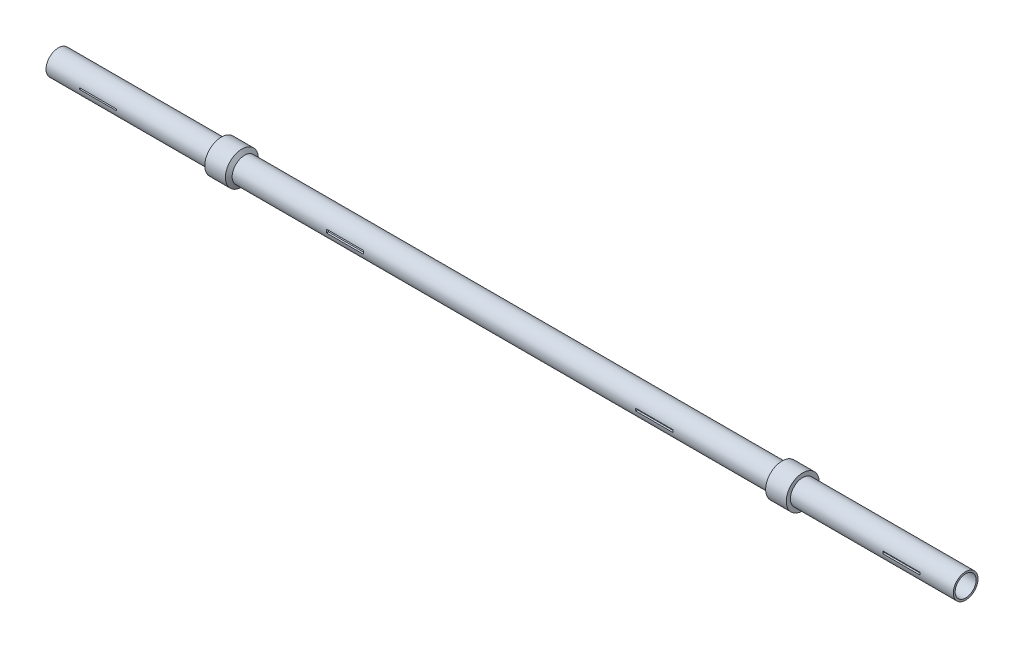
ISO-10303-21;
HEADER;
FILE_DESCRIPTION(('STEP AP214'),'2;1');
FILE_NAME('part.step','',(''),(''),'','','');
FILE_SCHEMA(('AUTOMOTIVE_DESIGN { 1 0 10303 214 1 1 1 1 }'));
ENDSEC;
DATA;
#1=APPLICATION_CONTEXT('core data for automotive mechanical design processes');
#2=APPLICATION_PROTOCOL_DEFINITION('international standard','automotive_design',2000,#1);
#3=PRODUCT_CONTEXT('',#1,'mechanical');
#4=PRODUCT('Part','Part','',(#3));
#5=PRODUCT_RELATED_PRODUCT_CATEGORY('part','',(#4));
#6=PRODUCT_DEFINITION_FORMATION('','',#4);
#7=PRODUCT_DEFINITION_CONTEXT('part definition',#1,'design');
#8=PRODUCT_DEFINITION('design','',#6,#7);
#9=PRODUCT_DEFINITION_SHAPE('','',#8);
#10=(LENGTH_UNIT() NAMED_UNIT(*) SI_UNIT(.MILLI.,.METRE.));
#11=(NAMED_UNIT(*) PLANE_ANGLE_UNIT() SI_UNIT($,.RADIAN.));
#12=(NAMED_UNIT(*) SI_UNIT($,.STERADIAN.) SOLID_ANGLE_UNIT());
#13=UNCERTAINTY_MEASURE_WITH_UNIT(LENGTH_MEASURE(1.E-05),#10,'distance_accuracy_value','');
#14=(GEOMETRIC_REPRESENTATION_CONTEXT(3) GLOBAL_UNCERTAINTY_ASSIGNED_CONTEXT((#13)) GLOBAL_UNIT_ASSIGNED_CONTEXT((#10,
#11,#12)) REPRESENTATION_CONTEXT('',''));
#15=CARTESIAN_POINT('',(0.,0.,0.));
#16=DIRECTION('',(0.,0.,1.));
#17=DIRECTION('',(1.,0.,0.));
#18=AXIS2_PLACEMENT_3D('',#15,#16,#17);
#19=CARTESIAN_POINT('',(-1343.71911040698,0.,0.));
#20=DIRECTION('',(1.,0.,0.));
#21=DIRECTION('',(0.,0.,-1.));
#22=AXIS2_PLACEMENT_3D('',#19,#20,#21);
#23=CYLINDRICAL_SURFACE('',#22,12.7212399784205);
#24=DIRECTION('',(1.,0.,0.));
#25=VECTOR('',#24,1.);
#26=CARTESIAN_POINT('',(-1343.71911040698,-1.50069655306055,12.6324129304024));
#27=LINE('',#26,#25);
#28=CARTESIAN_POINT('',(815.791337888926,-1.50069655306042,12.6324129304024));
#29=VERTEX_POINT('',#28);
#30=CARTESIAN_POINT('',(770.770441297112,-1.50069655306042,12.6324129304024));
#31=VERTEX_POINT('',#30);
#32=EDGE_CURVE('E266',#29,#31,#27,.F.);
#33=ORIENTED_EDGE('',*,*,#32,.F.);
#34=CARTESIAN_POINT('',(815.791337888926,0.,0.));
#35=DIRECTION('',(-1.,0.,0.));
#36=DIRECTION('',(0.,0.,1.));
#37=AXIS2_PLACEMENT_3D('',#34,#35,#36);
#38=CIRCLE('',#37,12.7212399784205);
#39=CARTESIAN_POINT('',(815.791337888926,1.50069655306054,12.6324129304024));
#40=VERTEX_POINT('',#39);
#41=EDGE_CURVE('E272',#29,#40,#38,.T.);
#42=ORIENTED_EDGE('',*,*,#41,.T.);
#43=DIRECTION('',(1.,0.,0.));
#44=VECTOR('',#43,1.);
#45=CARTESIAN_POINT('',(-1343.71911040698,1.50069655306041,12.6324129304024));
#46=LINE('',#45,#44);
#47=CARTESIAN_POINT('',(770.770441297112,1.50069655306041,12.6324129304024));
#48=VERTEX_POINT('',#47);
#49=EDGE_CURVE('E252',#40,#48,#46,.F.);
#50=ORIENTED_EDGE('',*,*,#49,.T.);
#51=CARTESIAN_POINT('',(770.770441297112,0.,0.));
#52=DIRECTION('',(-1.,0.,0.));
#53=DIRECTION('',(0.,0.,1.));
#54=AXIS2_PLACEMENT_3D('',#51,#52,#53);
#55=CIRCLE('',#54,12.7212399784205);
#56=EDGE_CURVE('E251',#31,#48,#55,.T.);
#57=ORIENTED_EDGE('',*,*,#56,.F.);
#58=EDGE_LOOP('',(#33,#42,#50,#57));
#59=FACE_BOUND('',#58,.T.);
#60=DIRECTION('',(1.,0.,0.));
#61=VECTOR('',#60,1.);
#62=CARTESIAN_POINT('',(-1343.71911040698,-1.50069655306065,12.6324129304024));
#63=LINE('',#62,#61);
#64=CARTESIAN_POINT('',(516.291337888926,-1.50069655306054,12.6324129304024));
#65=VERTEX_POINT('',#64);
#66=CARTESIAN_POINT('',(471.270441297112,-1.50069655306054,12.6324129304024));
#67=VERTEX_POINT('',#66);
#68=EDGE_CURVE('E301',#65,#67,#63,.F.);
#69=ORIENTED_EDGE('',*,*,#68,.F.);
#70=CARTESIAN_POINT('',(516.291337888926,0.,0.));
#71=DIRECTION('',(-1.,0.,0.));
#72=DIRECTION('',(0.,-1.,0.));
#73=AXIS2_PLACEMENT_3D('',#70,#71,#72);
#74=CIRCLE('',#73,12.7212399784205);
#75=CARTESIAN_POINT('',(516.291337888927,1.50069655306063,12.6324129304024));
#76=VERTEX_POINT('',#75);
#77=EDGE_CURVE('E308',#65,#76,#74,.T.);
#78=ORIENTED_EDGE('',*,*,#77,.T.);
#79=DIRECTION('',(1.,0.,0.));
#80=VECTOR('',#79,1.);
#81=CARTESIAN_POINT('',(-1343.71911040698,1.50069655306052,12.6324129304024));
#82=LINE('',#81,#80);
#83=CARTESIAN_POINT('',(471.270441297112,1.50069655306052,12.6324129304024));
#84=VERTEX_POINT('',#83);
#85=EDGE_CURVE('E291',#76,#84,#82,.F.);
#86=ORIENTED_EDGE('',*,*,#85,.T.);
#87=CARTESIAN_POINT('',(471.270441297112,0.,0.));
#88=DIRECTION('',(-1.,0.,0.));
#89=DIRECTION('',(0.,0.,1.));
#90=AXIS2_PLACEMENT_3D('',#87,#88,#89);
#91=CIRCLE('',#90,12.7212399784205);
#92=EDGE_CURVE('E297',#67,#84,#91,.T.);
#93=ORIENTED_EDGE('',*,*,#92,.F.);
#94=EDGE_LOOP('',(#69,#78,#86,#93));
#95=FACE_BOUND('',#94,.T.);
#96=DIRECTION('',(1.,0.,0.));
#97=VECTOR('',#96,1.);
#98=CARTESIAN_POINT('',(-1343.71911040698,-2.02321230294039,12.5593215806347));
#99=LINE('',#98,#97);
#100=CARTESIAN_POINT('',(141.255975495604,-2.02321230294031,12.5593215806347));
#101=VERTEX_POINT('',#100);
#102=CARTESIAN_POINT('',(96.3058036904345,-2.02321230294031,12.5593215806347));
#103=VERTEX_POINT('',#102);
#104=EDGE_CURVE('E334',#101,#103,#99,.F.);
#105=ORIENTED_EDGE('',*,*,#104,.F.);
#106=CARTESIAN_POINT('',(141.255975495604,0.,0.));
#107=DIRECTION('',(-1.,0.,0.));
#108=DIRECTION('',(0.,0.,1.));
#109=AXIS2_PLACEMENT_3D('',#106,#107,#108);
#110=CIRCLE('',#109,12.7212399784205);
#111=CARTESIAN_POINT('',(141.255975495604,2.02321230294035,12.5593215806347));
#112=VERTEX_POINT('',#111);
#113=EDGE_CURVE('E338',#101,#112,#110,.T.);
#114=ORIENTED_EDGE('',*,*,#113,.T.);
#115=DIRECTION('',(1.,0.,0.));
#116=VECTOR('',#115,1.);
#117=CARTESIAN_POINT('',(-1343.71911040698,2.02321230294027,12.5593215806347));
#118=LINE('',#117,#116);
#119=CARTESIAN_POINT('',(96.3058036904343,2.02321230294027,12.5593215806347));
#120=VERTEX_POINT('',#119);
#121=EDGE_CURVE('E324',#112,#120,#118,.F.);
#122=ORIENTED_EDGE('',*,*,#121,.T.);
#123=CARTESIAN_POINT('',(96.3058036904345,0.,0.));
#124=DIRECTION('',(-1.,0.,0.));
#125=DIRECTION('',(0.,0.,1.));
#126=AXIS2_PLACEMENT_3D('',#123,#124,#125);
#127=CIRCLE('',#126,12.7212399784205);
#128=EDGE_CURVE('E330',#103,#120,#127,.T.);
#129=ORIENTED_EDGE('',*,*,#128,.F.);
#130=EDGE_LOOP('',(#105,#114,#122,#129));
#131=FACE_BOUND('',#130,.T.);
#132=DIRECTION('',(1.,0.,0.));
#133=VECTOR('',#132,1.);
#134=CARTESIAN_POINT('',(-1343.71911040698,0.911393527752899,12.6885502885923));
#135=LINE('',#134,#133);
#136=CARTESIAN_POINT('',(-158.169682229954,0.911393527752899,12.6885502885923));
#137=VERTEX_POINT('',#136);
#138=CARTESIAN_POINT('',(-203.268538584007,0.911393527752899,12.6885502885923));
#139=VERTEX_POINT('',#138);
#140=EDGE_CURVE('E416',#137,#139,#135,.F.);
#141=ORIENTED_EDGE('',*,*,#140,.T.);
#142=CARTESIAN_POINT('',(-203.268538584007,0.,0.));
#143=DIRECTION('',(1.,0.,0.));
#144=DIRECTION('',(0.,0.,-1.));
#145=AXIS2_PLACEMENT_3D('',#142,#143,#144);
#146=CIRCLE('',#145,12.7212399784205);
#147=CARTESIAN_POINT('',(-203.268538584007,-0.911393527752899,12.6885502885923));
#148=VERTEX_POINT('',#147);
#149=EDGE_CURVE('E420',#139,#148,#146,.T.);
#150=ORIENTED_EDGE('',*,*,#149,.T.);
#151=DIRECTION('',(1.,0.,0.));
#152=VECTOR('',#151,1.);
#153=CARTESIAN_POINT('',(-1343.71911040698,-0.911393527752899,12.6885502885923));
#154=LINE('',#153,#152);
#155=CARTESIAN_POINT('',(-158.169682229954,-0.911393527752899,12.6885502885923));
#156=VERTEX_POINT('',#155);
#157=EDGE_CURVE('E409',#156,#148,#154,.F.);
#158=ORIENTED_EDGE('',*,*,#157,.F.);
#159=CARTESIAN_POINT('',(-158.169682229954,0.,0.));
#160=DIRECTION('',(-1.,0.,0.));
#161=DIRECTION('',(0.,0.,1.));
#162=AXIS2_PLACEMENT_3D('',#159,#160,#161);
#163=CIRCLE('',#162,12.7212399784205);
#164=EDGE_CURVE('E413',#156,#137,#163,.T.);
#165=ORIENTED_EDGE('',*,*,#164,.T.);
#166=EDGE_LOOP('',(#141,#150,#158,#165));
#167=FACE_BOUND('',#166,.T.);
#168=CARTESIAN_POINT('',(-243.719110406981,0.,0.));
#169=DIRECTION('',(-1.,0.,0.));
#170=DIRECTION('',(0.,0.,1.));
#171=AXIS2_PLACEMENT_3D('',#168,#169,#170);
#172=CIRCLE('',#171,12.7212399784205);
#173=CARTESIAN_POINT('',(-243.719110406981,0.,12.7212399784205));
#174=VERTEX_POINT('',#173);
#175=EDGE_CURVE('E378',#174,#174,#172,.F.);
#176=ORIENTED_EDGE('',*,*,#175,.F.);
#177=EDGE_LOOP('',(#176));
#178=FACE_BOUND('',#177,.T.);
#179=CARTESIAN_POINT('',(856.280889593019,0.,0.));
#180=DIRECTION('',(-1.,0.,0.));
#181=DIRECTION('',(0.,0.,1.));
#182=AXIS2_PLACEMENT_3D('',#179,#180,#181);
#183=CIRCLE('',#182,12.7212399784205);
#184=CARTESIAN_POINT('',(856.280889593019,0.,12.7212399784205));
#185=VERTEX_POINT('',#184);
#186=EDGE_CURVE('E375',#185,#185,#183,.T.);
#187=ORIENTED_EDGE('',*,*,#186,.F.);
#188=EDGE_LOOP('',(#187));
#189=FACE_BOUND('',#188,.T.);
#190=DIRECTION('',(1.,0.,0.));
#191=VECTOR('',#190,1.);
#192=CARTESIAN_POINT('',(-1343.71911040698,-0.911393527752899,-12.6885502885923));
#193=LINE('',#192,#191);
#194=CARTESIAN_POINT('',(-203.268538584007,-0.911393527752899,-12.6885502885923));
#195=VERTEX_POINT('',#194);
#196=CARTESIAN_POINT('',(-158.169682229954,-0.911393527752899,-12.6885502885923));
#197=VERTEX_POINT('',#196);
#198=EDGE_CURVE('E423',#195,#197,#193,.T.);
#199=ORIENTED_EDGE('',*,*,#198,.F.);
#200=CARTESIAN_POINT('',(-203.268538584007,0.911393527752899,-12.6885502885923));
#201=VERTEX_POINT('',#200);
#202=EDGE_CURVE('E424',#195,#201,#146,.T.);
#203=ORIENTED_EDGE('',*,*,#202,.T.);
#204=DIRECTION('',(1.,0.,0.));
#205=VECTOR('',#204,1.);
#206=CARTESIAN_POINT('',(-1343.71911040698,0.911393527752899,-12.6885502885923));
#207=LINE('',#206,#205);
#208=CARTESIAN_POINT('',(-158.169682229954,0.911393527752899,-12.6885502885923));
#209=VERTEX_POINT('',#208);
#210=EDGE_CURVE('E426',#201,#209,#207,.T.);
#211=ORIENTED_EDGE('',*,*,#210,.T.);
#212=EDGE_CURVE('E417',#209,#197,#163,.T.);
#213=ORIENTED_EDGE('',*,*,#212,.T.);
#214=EDGE_LOOP('',(#199,#203,#211,#213));
#215=FACE_BOUND('',#214,.T.);
#216=DIRECTION('',(1.,0.,0.));
#217=VECTOR('',#216,1.);
#218=CARTESIAN_POINT('',(-1343.71911040698,2.02321230294027,-12.5593215806347));
#219=LINE('',#218,#217);
#220=CARTESIAN_POINT('',(96.3058036904344,2.02321230294035,-12.5593215806347));
#221=VERTEX_POINT('',#220);
#222=CARTESIAN_POINT('',(141.255975495604,2.02321230294027,-12.5593215806347));
#223=VERTEX_POINT('',#222);
#224=EDGE_CURVE('E327',#221,#223,#219,.T.);
#225=ORIENTED_EDGE('',*,*,#224,.T.);
#226=CARTESIAN_POINT('',(141.255975495604,-2.02321230294031,-12.5593215806347));
#227=VERTEX_POINT('',#226);
#228=EDGE_CURVE('E341',#223,#227,#110,.T.);
#229=ORIENTED_EDGE('',*,*,#228,.T.);
#230=DIRECTION('',(1.,0.,0.));
#231=VECTOR('',#230,1.);
#232=CARTESIAN_POINT('',(-1343.71911040698,-2.02321230294039,-12.5593215806347));
#233=LINE('',#232,#231);
#234=CARTESIAN_POINT('',(96.3058036904345,-2.02321230294031,-12.5593215806347));
#235=VERTEX_POINT('',#234);
#236=EDGE_CURVE('E336',#235,#227,#233,.T.);
#237=ORIENTED_EDGE('',*,*,#236,.F.);
#238=EDGE_CURVE('E333',#221,#235,#127,.T.);
#239=ORIENTED_EDGE('',*,*,#238,.F.);
#240=EDGE_LOOP('',(#225,#229,#237,#239));
#241=FACE_BOUND('',#240,.T.);
#242=DIRECTION('',(1.,0.,0.));
#243=VECTOR('',#242,1.);
#244=CARTESIAN_POINT('',(-1343.71911040698,1.50069655306052,-12.6324129304024));
#245=LINE('',#244,#243);
#246=CARTESIAN_POINT('',(471.270441297112,1.50069655306063,-12.6324129304024));
#247=VERTEX_POINT('',#246);
#248=CARTESIAN_POINT('',(516.291337888927,1.50069655306052,-12.6324129304024));
#249=VERTEX_POINT('',#248);
#250=EDGE_CURVE('E294',#247,#249,#245,.T.);
#251=ORIENTED_EDGE('',*,*,#250,.T.);
#252=CARTESIAN_POINT('',(516.291337888926,-1.50069655306054,-12.6324129304024));
#253=VERTEX_POINT('',#252);
#254=EDGE_CURVE('E305',#249,#253,#74,.T.);
#255=ORIENTED_EDGE('',*,*,#254,.T.);
#256=DIRECTION('',(1.,0.,0.));
#257=VECTOR('',#256,1.);
#258=CARTESIAN_POINT('',(-1343.71911040698,-1.50069655306065,-12.6324129304024));
#259=LINE('',#258,#257);
#260=CARTESIAN_POINT('',(471.270441297112,-1.50069655306054,-12.6324129304024));
#261=VERTEX_POINT('',#260);
#262=EDGE_CURVE('E303',#261,#253,#259,.T.);
#263=ORIENTED_EDGE('',*,*,#262,.F.);
#264=EDGE_CURVE('E300',#247,#261,#91,.T.);
#265=ORIENTED_EDGE('',*,*,#264,.F.);
#266=EDGE_LOOP('',(#251,#255,#263,#265));
#267=FACE_BOUND('',#266,.T.);
#268=DIRECTION('',(1.,0.,0.));
#269=VECTOR('',#268,1.);
#270=CARTESIAN_POINT('',(-1343.71911040698,1.50069655306041,-12.6324129304024));
#271=LINE('',#270,#269);
#272=CARTESIAN_POINT('',(770.770441297112,1.50069655306054,-12.6324129304024));
#273=VERTEX_POINT('',#272);
#274=CARTESIAN_POINT('',(815.791337888926,1.50069655306041,-12.6324129304024));
#275=VERTEX_POINT('',#274);
#276=EDGE_CURVE('E243',#273,#275,#271,.T.);
#277=ORIENTED_EDGE('',*,*,#276,.T.);
#278=CARTESIAN_POINT('',(815.791337888926,-1.50069655306042,-12.6324129304024));
#279=VERTEX_POINT('',#278);
#280=EDGE_CURVE('E275',#275,#279,#38,.T.);
#281=ORIENTED_EDGE('',*,*,#280,.T.);
#282=DIRECTION('',(1.,0.,0.));
#283=VECTOR('',#282,1.);
#284=CARTESIAN_POINT('',(-1343.71911040698,-1.50069655306055,-12.6324129304024));
#285=LINE('',#284,#283);
#286=CARTESIAN_POINT('',(770.770441297112,-1.50069655306042,-12.6324129304024));
#287=VERTEX_POINT('',#286);
#288=EDGE_CURVE('E265',#287,#279,#285,.T.);
#289=ORIENTED_EDGE('',*,*,#288,.F.);
#290=EDGE_CURVE('E257',#273,#287,#55,.T.);
#291=ORIENTED_EDGE('',*,*,#290,.F.);
#292=EDGE_LOOP('',(#277,#281,#289,#291));
#293=FACE_BOUND('',#292,.T.);
#294=ADVANCED_FACE('F34',(#59,#95,#131,#167,#178,#189,#215,#241,#267,#293),#23,.F.);
#295=CARTESIAN_POINT('',(-243.719110406981,0.,0.));
#296=DIRECTION('',(-1.,0.,0.));
#297=DIRECTION('',(0.,0.,1.));
#298=AXIS2_PLACEMENT_3D('',#295,#296,#297);
#299=CYLINDRICAL_SURFACE('',#298,15.0000000000001);
#300=DIRECTION('',(-1.,0.,0.));
#301=VECTOR('',#300,1.);
#302=CARTESIAN_POINT('',(-243.719110406981,-1.50069655306048,-14.9247415339641));
#303=LINE('',#302,#301);
#304=CARTESIAN_POINT('',(815.791337888926,-1.50069655306042,-14.9247415339641));
#305=VERTEX_POINT('',#304);
#306=CARTESIAN_POINT('',(770.770441297112,-1.50069655306042,-14.9247415339642));
#307=VERTEX_POINT('',#306);
#308=EDGE_CURVE('E468',#305,#307,#303,.T.);
#309=ORIENTED_EDGE('',*,*,#308,.F.);
#310=CARTESIAN_POINT('',(815.791337888927,0.,0.));
#311=DIRECTION('',(-1.,0.,0.));
#312=DIRECTION('',(0.,0.,1.));
#313=AXIS2_PLACEMENT_3D('',#310,#311,#312);
#314=CIRCLE('',#313,15.0000000000001);
#315=CARTESIAN_POINT('',(815.791337888926,1.50069655306054,-14.9247415339641));
#316=VERTEX_POINT('',#315);
#317=EDGE_CURVE('E44',#305,#316,#314,.F.);
#318=ORIENTED_EDGE('',*,*,#317,.T.);
#319=DIRECTION('',(-1.,0.,0.));
#320=VECTOR('',#319,1.);
#321=CARTESIAN_POINT('',(-243.719110406981,1.50069655306048,-14.9247415339641));
#322=LINE('',#321,#320);
#323=CARTESIAN_POINT('',(770.770441297112,1.50069655306048,-14.9247415339641));
#324=VERTEX_POINT('',#323);
#325=EDGE_CURVE('E465',#316,#324,#322,.T.);
#326=ORIENTED_EDGE('',*,*,#325,.T.);
#327=CARTESIAN_POINT('',(770.770441297112,0.,0.));
#328=DIRECTION('',(-1.,0.,0.));
#329=DIRECTION('',(0.,0.,1.));
#330=AXIS2_PLACEMENT_3D('',#327,#328,#329);
#331=CIRCLE('',#330,15.0000000000001);
#332=EDGE_CURVE('E260',#307,#324,#331,.F.);
#333=ORIENTED_EDGE('',*,*,#332,.F.);
#334=EDGE_LOOP('',(#309,#318,#326,#333));
#335=FACE_BOUND('',#334,.T.);
#336=CARTESIAN_POINT('',(856.280889593019,0.,0.));
#337=DIRECTION('',(-1.,0.,0.));
#338=DIRECTION('',(0.,0.,1.));
#339=AXIS2_PLACEMENT_3D('',#336,#337,#338);
#340=CIRCLE('',#339,15.);
#341=CARTESIAN_POINT('',(856.280889593019,0.,15.));
#342=VERTEX_POINT('',#341);
#343=EDGE_CURVE('E406',#342,#342,#340,.T.);
#344=ORIENTED_EDGE('',*,*,#343,.T.);
#345=EDGE_LOOP('',(#344));
#346=FACE_BOUND('',#345,.T.);
#347=CARTESIAN_POINT('',(658.780889593019,0.,0.));
#348=DIRECTION('',(-1.,0.,0.));
#349=DIRECTION('',(0.,0.,1.));
#350=AXIS2_PLACEMENT_3D('',#347,#348,#349);
#351=CIRCLE('',#350,15.0000000000001);
#352=CARTESIAN_POINT('',(658.780889593019,0.,15.0000000000001));
#353=VERTEX_POINT('',#352);
#354=EDGE_CURVE('E403',#353,#353,#351,.T.);
#355=ORIENTED_EDGE('',*,*,#354,.F.);
#356=EDGE_LOOP('',(#355));
#357=FACE_BOUND('',#356,.T.);
#358=DIRECTION('',(-1.,0.,0.));
#359=VECTOR('',#358,1.);
#360=CARTESIAN_POINT('',(-243.719110406981,1.50069655306048,14.9247415339641));
#361=LINE('',#360,#359);
#362=CARTESIAN_POINT('',(770.770441297112,1.50069655306054,14.9247415339641));
#363=VERTEX_POINT('',#362);
#364=CARTESIAN_POINT('',(815.791337888927,1.50069655306048,14.9247415339641));
#365=VERTEX_POINT('',#364);
#366=EDGE_CURVE('E471',#363,#365,#361,.F.);
#367=ORIENTED_EDGE('',*,*,#366,.T.);
#368=CARTESIAN_POINT('',(815.791337888926,-1.50069655306042,14.9247415339641));
#369=VERTEX_POINT('',#368);
#370=EDGE_CURVE('E11',#365,#369,#314,.F.);
#371=ORIENTED_EDGE('',*,*,#370,.T.);
#372=DIRECTION('',(-1.,0.,0.));
#373=VECTOR('',#372,1.);
#374=CARTESIAN_POINT('',(-243.719110406981,-1.50069655306048,14.9247415339641));
#375=LINE('',#374,#373);
#376=CARTESIAN_POINT('',(770.770441297112,-1.50069655306042,14.9247415339642));
#377=VERTEX_POINT('',#376);
#378=EDGE_CURVE('E38',#377,#369,#375,.F.);
#379=ORIENTED_EDGE('',*,*,#378,.F.);
#380=EDGE_CURVE('E469',#363,#377,#331,.F.);
#381=ORIENTED_EDGE('',*,*,#380,.F.);
#382=EDGE_LOOP('',(#367,#371,#379,#381));
#383=FACE_BOUND('',#382,.T.);
#384=ADVANCED_FACE('F492',(#335,#346,#357,#383),#299,.T.);
#385=CARTESIAN_POINT('',(-243.719110406981,0.,0.));
#386=DIRECTION('',(-1.,0.,0.));
#387=DIRECTION('',(0.,0.,1.));
#388=AXIS2_PLACEMENT_3D('',#385,#386,#387);
#389=CYLINDRICAL_SURFACE('',#388,15.);
#390=DIRECTION('',(-1.,0.,0.));
#391=VECTOR('',#390,1.);
#392=CARTESIAN_POINT('',(-243.719110406981,-1.50069655306058,-14.9247415339641));
#393=LINE('',#392,#391);
#394=CARTESIAN_POINT('',(516.291337888926,-1.50069655306054,-14.9247415339641));
#395=VERTEX_POINT('',#394);
#396=CARTESIAN_POINT('',(471.270441297112,-1.50069655306054,-14.9247415339641));
#397=VERTEX_POINT('',#396);
#398=EDGE_CURVE('E453',#395,#397,#393,.T.);
#399=ORIENTED_EDGE('',*,*,#398,.F.);
#400=CARTESIAN_POINT('',(516.291337888926,0.,0.));
#401=DIRECTION('',(-1.,0.,0.));
#402=DIRECTION('',(0.,-1.,0.));
#403=AXIS2_PLACEMENT_3D('',#400,#401,#402);
#404=CIRCLE('',#403,15.);
#405=CARTESIAN_POINT('',(516.291337888927,1.50069655306063,-14.9247415339641));
#406=VERTEX_POINT('',#405);
#407=EDGE_CURVE('E456',#395,#406,#404,.F.);
#408=ORIENTED_EDGE('',*,*,#407,.T.);
#409=DIRECTION('',(-1.,0.,0.));
#410=VECTOR('',#409,1.);
#411=CARTESIAN_POINT('',(-243.719110406981,1.50069655306058,-14.9247415339641));
#412=LINE('',#411,#410);
#413=CARTESIAN_POINT('',(471.270441297112,1.50069655306058,-14.9247415339641));
#414=VERTEX_POINT('',#413);
#415=EDGE_CURVE('E447',#406,#414,#412,.T.);
#416=ORIENTED_EDGE('',*,*,#415,.T.);
#417=CARTESIAN_POINT('',(471.270441297112,0.,0.));
#418=DIRECTION('',(-1.,0.,0.));
#419=DIRECTION('',(0.,0.,1.));
#420=AXIS2_PLACEMENT_3D('',#417,#418,#419);
#421=CIRCLE('',#420,15.);
#422=EDGE_CURVE('E450',#397,#414,#421,.F.);
#423=ORIENTED_EDGE('',*,*,#422,.F.);
#424=EDGE_LOOP('',(#399,#408,#416,#423));
#425=FACE_BOUND('',#424,.T.);
#426=DIRECTION('',(-1.,0.,0.));
#427=VECTOR('',#426,1.);
#428=CARTESIAN_POINT('',(-243.719110406981,-2.02321230294033,-14.8629274363172));
#429=LINE('',#428,#427);
#430=CARTESIAN_POINT('',(141.255975495604,-2.02321230294031,-14.8629274363172));
#431=VERTEX_POINT('',#430);
#432=CARTESIAN_POINT('',(96.3058036904344,-2.02321230294031,-14.8629274363172));
#433=VERTEX_POINT('',#432);
#434=EDGE_CURVE('E435',#431,#433,#429,.T.);
#435=ORIENTED_EDGE('',*,*,#434,.F.);
#436=CARTESIAN_POINT('',(141.255975495604,0.,0.));
#437=DIRECTION('',(-1.,0.,0.));
#438=DIRECTION('',(0.,0.,1.));
#439=AXIS2_PLACEMENT_3D('',#436,#437,#438);
#440=CIRCLE('',#439,15.);
#441=CARTESIAN_POINT('',(141.255975495604,2.02321230294035,-14.8629274363172));
#442=VERTEX_POINT('',#441);
#443=EDGE_CURVE('E438',#431,#442,#440,.F.);
#444=ORIENTED_EDGE('',*,*,#443,.T.);
#445=DIRECTION('',(-1.,0.,0.));
#446=VECTOR('',#445,1.);
#447=CARTESIAN_POINT('',(-243.719110406981,2.02321230294033,-14.8629274363172));
#448=LINE('',#447,#446);
#449=CARTESIAN_POINT('',(96.3058036904344,2.02321230294033,-14.8629274363172));
#450=VERTEX_POINT('',#449);
#451=EDGE_CURVE('E429',#442,#450,#448,.T.);
#452=ORIENTED_EDGE('',*,*,#451,.T.);
#453=CARTESIAN_POINT('',(96.3058036904344,0.,0.));
#454=DIRECTION('',(-1.,0.,0.));
#455=DIRECTION('',(0.,0.,1.));
#456=AXIS2_PLACEMENT_3D('',#453,#454,#455);
#457=CIRCLE('',#456,15.);
#458=EDGE_CURVE('E432',#433,#450,#457,.F.);
#459=ORIENTED_EDGE('',*,*,#458,.F.);
#460=EDGE_LOOP('',(#435,#444,#452,#459));
#461=FACE_BOUND('',#460,.T.);
#462=CARTESIAN_POINT('',(630.572753037591,0.,0.));
#463=DIRECTION('',(-1.,0.,0.));
#464=DIRECTION('',(0.,0.,1.));
#465=AXIS2_PLACEMENT_3D('',#462,#463,#464);
#466=CIRCLE('',#465,15.);
#467=CARTESIAN_POINT('',(630.572753037591,0.,15.));
#468=VERTEX_POINT('',#467);
#469=EDGE_CURVE('E394',#468,#468,#466,.T.);
#470=ORIENTED_EDGE('',*,*,#469,.T.);
#471=EDGE_LOOP('',(#470));
#472=FACE_BOUND('',#471,.T.);
#473=CARTESIAN_POINT('',(-18.0109738515526,0.,0.));
#474=DIRECTION('',(-1.,0.,0.));
#475=DIRECTION('',(0.,0.,1.));
#476=AXIS2_PLACEMENT_3D('',#473,#474,#475);
#477=CIRCLE('',#476,15.);
#478=CARTESIAN_POINT('',(-18.0109738515526,0.,15.));
#479=VERTEX_POINT('',#478);
#480=EDGE_CURVE('E391',#479,#479,#477,.T.);
#481=ORIENTED_EDGE('',*,*,#480,.F.);
#482=EDGE_LOOP('',(#481));
#483=FACE_BOUND('',#482,.T.);
#484=DIRECTION('',(-1.,0.,0.));
#485=VECTOR('',#484,1.);
#486=CARTESIAN_POINT('',(-243.719110406981,2.02321230294033,14.8629274363172));
#487=LINE('',#486,#485);
#488=CARTESIAN_POINT('',(96.3058036904344,2.02321230294035,14.8629274363172));
#489=VERTEX_POINT('',#488);
#490=CARTESIAN_POINT('',(141.255975495604,2.02321230294033,14.8629274363172));
#491=VERTEX_POINT('',#490);
#492=EDGE_CURVE('E441',#489,#491,#487,.F.);
#493=ORIENTED_EDGE('',*,*,#492,.T.);
#494=CARTESIAN_POINT('',(141.255975495604,-2.02321230294031,14.8629274363172));
#495=VERTEX_POINT('',#494);
#496=EDGE_CURVE('E442',#491,#495,#440,.F.);
#497=ORIENTED_EDGE('',*,*,#496,.T.);
#498=DIRECTION('',(-1.,0.,0.));
#499=VECTOR('',#498,1.);
#500=CARTESIAN_POINT('',(-243.719110406981,-2.02321230294033,14.8629274363172));
#501=LINE('',#500,#499);
#502=CARTESIAN_POINT('',(96.3058036904344,-2.02321230294031,14.8629274363172));
#503=VERTEX_POINT('',#502);
#504=EDGE_CURVE('E445',#503,#495,#501,.F.);
#505=ORIENTED_EDGE('',*,*,#504,.F.);
#506=EDGE_CURVE('E436',#489,#503,#457,.F.);
#507=ORIENTED_EDGE('',*,*,#506,.F.);
#508=EDGE_LOOP('',(#493,#497,#505,#507));
#509=FACE_BOUND('',#508,.T.);
#510=DIRECTION('',(-1.,0.,0.));
#511=VECTOR('',#510,1.);
#512=CARTESIAN_POINT('',(-243.719110406981,1.50069655306058,14.9247415339641));
#513=LINE('',#512,#511);
#514=CARTESIAN_POINT('',(471.270441297112,1.50069655306063,14.9247415339641));
#515=VERTEX_POINT('',#514);
#516=CARTESIAN_POINT('',(516.291337888926,1.50069655306058,14.9247415339641));
#517=VERTEX_POINT('',#516);
#518=EDGE_CURVE('E459',#515,#517,#513,.F.);
#519=ORIENTED_EDGE('',*,*,#518,.T.);
#520=CARTESIAN_POINT('',(516.291337888926,-1.50069655306054,14.9247415339641));
#521=VERTEX_POINT('',#520);
#522=EDGE_CURVE('E460',#517,#521,#404,.F.);
#523=ORIENTED_EDGE('',*,*,#522,.T.);
#524=DIRECTION('',(-1.,0.,0.));
#525=VECTOR('',#524,1.);
#526=CARTESIAN_POINT('',(-243.719110406981,-1.50069655306058,14.9247415339641));
#527=LINE('',#526,#525);
#528=CARTESIAN_POINT('',(471.270441297112,-1.50069655306054,14.9247415339641));
#529=VERTEX_POINT('',#528);
#530=EDGE_CURVE('E463',#529,#521,#527,.F.);
#531=ORIENTED_EDGE('',*,*,#530,.F.);
#532=EDGE_CURVE('E454',#515,#529,#421,.F.);
#533=ORIENTED_EDGE('',*,*,#532,.F.);
#534=EDGE_LOOP('',(#519,#523,#531,#533));
#535=FACE_BOUND('',#534,.T.);
#536=ADVANCED_FACE('F494',(#425,#461,#472,#483,#509,#535),#389,.T.);
#537=CARTESIAN_POINT('',(-243.719110406981,0.,0.));
#538=DIRECTION('',(-1.,0.,0.));
#539=DIRECTION('',(0.,0.,1.));
#540=AXIS2_PLACEMENT_3D('',#537,#538,#539);
#541=CYLINDRICAL_SURFACE('',#540,15.);
#542=DIRECTION('',(-1.,0.,0.));
#543=VECTOR('',#542,1.);
#544=CARTESIAN_POINT('',(-243.719110406981,0.911393527752899,-14.9722864599089));
#545=LINE('',#544,#543);
#546=CARTESIAN_POINT('',(-158.169682229954,0.911393527752899,-14.9722864599089));
#547=VERTEX_POINT('',#546);
#548=CARTESIAN_POINT('',(-203.268538584007,0.911393527752899,-14.9722864599089));
#549=VERTEX_POINT('',#548);
#550=EDGE_CURVE('E365',#547,#549,#545,.T.);
#551=ORIENTED_EDGE('',*,*,#550,.T.);
#552=CARTESIAN_POINT('',(-203.268538584007,0.,0.));
#553=DIRECTION('',(1.,0.,0.));
#554=DIRECTION('',(0.,0.,-1.));
#555=AXIS2_PLACEMENT_3D('',#552,#553,#554);
#556=CIRCLE('',#555,15.);
#557=CARTESIAN_POINT('',(-203.268538584007,-0.911393527752899,-14.9722864599089));
#558=VERTEX_POINT('',#557);
#559=EDGE_CURVE('E371',#549,#558,#556,.F.);
#560=ORIENTED_EDGE('',*,*,#559,.T.);
#561=DIRECTION('',(-1.,0.,0.));
#562=VECTOR('',#561,1.);
#563=CARTESIAN_POINT('',(-243.719110406981,-0.911393527752899,-14.9722864599089));
#564=LINE('',#563,#562);
#565=CARTESIAN_POINT('',(-158.169682229954,-0.911393527752899,-14.9722864599089));
#566=VERTEX_POINT('',#565);
#567=EDGE_CURVE('E357',#566,#558,#564,.T.);
#568=ORIENTED_EDGE('',*,*,#567,.F.);
#569=CARTESIAN_POINT('',(-158.169682229954,0.,0.));
#570=DIRECTION('',(-1.,0.,0.));
#571=DIRECTION('',(0.,0.,1.));
#572=AXIS2_PLACEMENT_3D('',#569,#570,#571);
#573=CIRCLE('',#572,15.);
#574=EDGE_CURVE('E364',#566,#547,#573,.F.);
#575=ORIENTED_EDGE('',*,*,#574,.T.);
#576=EDGE_LOOP('',(#551,#560,#568,#575));
#577=FACE_BOUND('',#576,.T.);
#578=CARTESIAN_POINT('',(-46.2191104069807,0.,0.));
#579=DIRECTION('',(-1.,0.,0.));
#580=DIRECTION('',(0.,0.,1.));
#581=AXIS2_PLACEMENT_3D('',#578,#579,#580);
#582=CIRCLE('',#581,15.);
#583=CARTESIAN_POINT('',(-46.2191104069807,0.,15.));
#584=VERTEX_POINT('',#583);
#585=EDGE_CURVE('E382',#584,#584,#582,.T.);
#586=ORIENTED_EDGE('',*,*,#585,.T.);
#587=EDGE_LOOP('',(#586));
#588=FACE_BOUND('',#587,.T.);
#589=CARTESIAN_POINT('',(-243.719110406981,0.,0.));
#590=DIRECTION('',(-1.,0.,0.));
#591=DIRECTION('',(0.,0.,1.));
#592=AXIS2_PLACEMENT_3D('',#589,#590,#591);
#593=CIRCLE('',#592,15.);
#594=CARTESIAN_POINT('',(-243.719110406981,0.,15.));
#595=VERTEX_POINT('',#594);
#596=EDGE_CURVE('E379',#595,#595,#593,.T.);
#597=ORIENTED_EDGE('',*,*,#596,.F.);
#598=EDGE_LOOP('',(#597));
#599=FACE_BOUND('',#598,.T.);
#600=DIRECTION('',(-1.,0.,0.));
#601=VECTOR('',#600,1.);
#602=CARTESIAN_POINT('',(-243.719110406981,-0.911393527752899,14.9722864599089));
#603=LINE('',#602,#601);
#604=CARTESIAN_POINT('',(-203.268538584007,-0.911393527752899,14.9722864599089));
#605=VERTEX_POINT('',#604);
#606=CARTESIAN_POINT('',(-158.169682229954,-0.911393527752899,14.9722864599089));
#607=VERTEX_POINT('',#606);
#608=EDGE_CURVE('E359',#605,#607,#603,.F.);
#609=ORIENTED_EDGE('',*,*,#608,.F.);
#610=CARTESIAN_POINT('',(-203.268538584007,0.911393527752899,14.9722864599089));
#611=VERTEX_POINT('',#610);
#612=EDGE_CURVE('E374',#605,#611,#556,.F.);
#613=ORIENTED_EDGE('',*,*,#612,.T.);
#614=DIRECTION('',(-1.,0.,0.));
#615=VECTOR('',#614,1.);
#616=CARTESIAN_POINT('',(-243.719110406981,0.911393527752899,14.9722864599089));
#617=LINE('',#616,#615);
#618=CARTESIAN_POINT('',(-158.169682229954,0.911393527752899,14.9722864599089));
#619=VERTEX_POINT('',#618);
#620=EDGE_CURVE('E368',#611,#619,#617,.F.);
#621=ORIENTED_EDGE('',*,*,#620,.T.);
#622=EDGE_CURVE('E361',#619,#607,#573,.F.);
#623=ORIENTED_EDGE('',*,*,#622,.T.);
#624=EDGE_LOOP('',(#609,#613,#621,#623));
#625=FACE_BOUND('',#624,.T.);
#626=ADVANCED_FACE('F500',(#577,#588,#599,#625),#541,.T.);
#627=CARTESIAN_POINT('',(856.280889593019,15.,0.));
#628=DIRECTION('',(1.,0.,0.));
#629=DIRECTION('',(0.,0.,-1.));
#630=AXIS2_PLACEMENT_3D('',#627,#628,#629);
#631=PLANE('',#630);
#632=ORIENTED_EDGE('',*,*,#343,.F.);
#633=EDGE_LOOP('',(#632));
#634=FACE_BOUND('',#633,.T.);
#635=ORIENTED_EDGE('',*,*,#186,.T.);
#636=EDGE_LOOP('',(#635));
#637=FACE_BOUND('',#636,.T.);
#638=ADVANCED_FACE('F36',(#634,#637),#631,.T.);
#639=CARTESIAN_POINT('',(-243.719110406981,0.,0.));
#640=DIRECTION('',(-1.,0.,0.));
#641=DIRECTION('',(0.,0.,1.));
#642=AXIS2_PLACEMENT_3D('',#639,#640,#641);
#643=PLANE('',#642);
#644=ORIENTED_EDGE('',*,*,#596,.T.);
#645=EDGE_LOOP('',(#644));
#646=FACE_BOUND('',#645,.T.);
#647=ORIENTED_EDGE('',*,*,#175,.T.);
#648=EDGE_LOOP('',(#647));
#649=FACE_BOUND('',#648,.T.);
#650=ADVANCED_FACE('F512',(#646,#649),#643,.T.);
#651=CARTESIAN_POINT('',(658.780889593019,15.0000000000001,0.));
#652=DIRECTION('',(1.,0.,0.));
#653=DIRECTION('',(0.,0.,-1.));
#654=AXIS2_PLACEMENT_3D('',#651,#652,#653);
#655=PLANE('',#654);
#656=ORIENTED_EDGE('',*,*,#354,.T.);
#657=EDGE_LOOP('',(#656));
#658=FACE_BOUND('',#657,.T.);
#659=CARTESIAN_POINT('',(658.780889593019,0.,0.));
#660=DIRECTION('',(-1.,0.,0.));
#661=DIRECTION('',(0.,0.,1.));
#662=AXIS2_PLACEMENT_3D('',#659,#660,#661);
#663=CIRCLE('',#662,19.9999999999996);
#664=CARTESIAN_POINT('',(658.780889593019,0.,19.9999999999996));
#665=VERTEX_POINT('',#664);
#666=EDGE_CURVE('E400',#665,#665,#663,.T.);
#667=ORIENTED_EDGE('',*,*,#666,.F.);
#668=EDGE_LOOP('',(#667));
#669=FACE_BOUND('',#668,.T.);
#670=ADVANCED_FACE('F508',(#658,#669),#655,.T.);
#671=CARTESIAN_POINT('',(-243.719110406981,0.,0.));
#672=DIRECTION('',(-1.,0.,0.));
#673=DIRECTION('',(0.,0.,1.));
#674=AXIS2_PLACEMENT_3D('',#671,#672,#673);
#675=CYLINDRICAL_SURFACE('',#674,19.9999999999996);
#676=ORIENTED_EDGE('',*,*,#666,.T.);
#677=EDGE_LOOP('',(#676));
#678=FACE_BOUND('',#677,.T.);
#679=CARTESIAN_POINT('',(633.780889593019,0.,0.));
#680=DIRECTION('',(-1.,0.,0.));
#681=DIRECTION('',(0.,0.,1.));
#682=AXIS2_PLACEMENT_3D('',#679,#680,#681);
#683=CIRCLE('',#682,19.9999999999996);
#684=CARTESIAN_POINT('',(633.780889593019,0.,19.9999999999996));
#685=VERTEX_POINT('',#684);
#686=EDGE_CURVE('E397',#685,#685,#683,.T.);
#687=ORIENTED_EDGE('',*,*,#686,.F.);
#688=EDGE_LOOP('',(#687));
#689=FACE_BOUND('',#688,.T.);
#690=ADVANCED_FACE('F511',(#678,#689),#675,.T.);
#691=CARTESIAN_POINT('',(630.572753037591,0.,0.));
#692=DIRECTION('',(1.,0.,0.));
#693=DIRECTION('',(0.,0.,-1.));
#694=AXIS2_PLACEMENT_3D('',#691,#692,#693);
#695=CONICAL_SURFACE('',#694,15.,1.000329539697);
#696=ORIENTED_EDGE('',*,*,#686,.T.);
#697=EDGE_LOOP('',(#696));
#698=FACE_BOUND('',#697,.T.);
#699=ORIENTED_EDGE('',*,*,#469,.F.);
#700=EDGE_LOOP('',(#699));
#701=FACE_BOUND('',#700,.T.);
#702=ADVANCED_FACE('F516',(#698,#701),#695,.T.);
#703=CARTESIAN_POINT('',(-21.2191104069807,0.,0.));
#704=DIRECTION('',(-1.,0.,0.));
#705=DIRECTION('',(0.,0.,1.));
#706=AXIS2_PLACEMENT_3D('',#703,#704,#705);
#707=CONICAL_SURFACE('',#706,20.,1.00032953969704);
#708=ORIENTED_EDGE('',*,*,#480,.T.);
#709=EDGE_LOOP('',(#708));
#710=FACE_BOUND('',#709,.T.);
#711=CARTESIAN_POINT('',(-21.2191104069807,0.,0.));
#712=DIRECTION('',(-1.,0.,0.));
#713=DIRECTION('',(0.,0.,1.));
#714=AXIS2_PLACEMENT_3D('',#711,#712,#713);
#715=CIRCLE('',#714,20.);
#716=CARTESIAN_POINT('',(-21.2191104069807,0.,20.));
#717=VERTEX_POINT('',#716);
#718=EDGE_CURVE('E388',#717,#717,#715,.T.);
#719=ORIENTED_EDGE('',*,*,#718,.F.);
#720=EDGE_LOOP('',(#719));
#721=FACE_BOUND('',#720,.T.);
#722=ADVANCED_FACE('F519',(#710,#721),#707,.T.);
#723=CARTESIAN_POINT('',(-243.719110406981,0.,0.));
#724=DIRECTION('',(-1.,0.,0.));
#725=DIRECTION('',(0.,0.,1.));
#726=AXIS2_PLACEMENT_3D('',#723,#724,#725);
#727=CYLINDRICAL_SURFACE('',#726,20.);
#728=ORIENTED_EDGE('',*,*,#718,.T.);
#729=EDGE_LOOP('',(#728));
#730=FACE_BOUND('',#729,.T.);
#731=CARTESIAN_POINT('',(-46.2191104069807,0.,0.));
#732=DIRECTION('',(-1.,0.,0.));
#733=DIRECTION('',(0.,0.,1.));
#734=AXIS2_PLACEMENT_3D('',#731,#732,#733);
#735=CIRCLE('',#734,20.);
#736=CARTESIAN_POINT('',(-46.2191104069807,0.,20.));
#737=VERTEX_POINT('',#736);
#738=EDGE_CURVE('E385',#737,#737,#735,.T.);
#739=ORIENTED_EDGE('',*,*,#738,.F.);
#740=EDGE_LOOP('',(#739));
#741=FACE_BOUND('',#740,.T.);
#742=ADVANCED_FACE('F524',(#730,#741),#727,.T.);
#743=CARTESIAN_POINT('',(-46.2191104069807,15.,0.));
#744=DIRECTION('',(-1.,0.,0.));
#745=DIRECTION('',(0.,0.,1.));
#746=AXIS2_PLACEMENT_3D('',#743,#744,#745);
#747=PLANE('',#746);
#748=ORIENTED_EDGE('',*,*,#738,.T.);
#749=EDGE_LOOP('',(#748));
#750=FACE_BOUND('',#749,.T.);
#751=ORIENTED_EDGE('',*,*,#585,.F.);
#752=EDGE_LOOP('',(#751));
#753=FACE_BOUND('',#752,.T.);
#754=ADVANCED_FACE('F528',(#750,#753),#747,.T.);
#755=CARTESIAN_POINT('',(0.,-0.911393527752899,-20.));
#756=DIRECTION('',(0.,-1.,0.));
#757=DIRECTION('',(0.,0.,-1.));
#758=AXIS2_PLACEMENT_3D('',#755,#756,#757);
#759=PLANE('',#758);
#760=ORIENTED_EDGE('',*,*,#608,.T.);
#761=DIRECTION('',(0.,0.,1.));
#762=VECTOR('',#761,1.);
#763=CARTESIAN_POINT('',(-158.169682229954,-0.911393527752899,-20.));
#764=LINE('',#763,#762);
#765=EDGE_CURVE('E351',#156,#607,#764,.T.);
#766=ORIENTED_EDGE('',*,*,#765,.F.);
#767=ORIENTED_EDGE('',*,*,#157,.T.);
#768=DIRECTION('',(0.,0.,1.));
#769=VECTOR('',#768,1.);
#770=CARTESIAN_POINT('',(-203.268538584007,-0.911393527752899,-20.));
#771=LINE('',#770,#769);
#772=EDGE_CURVE('E355',#148,#605,#771,.T.);
#773=ORIENTED_EDGE('',*,*,#772,.T.);
#774=EDGE_LOOP('',(#760,#766,#767,#773));
#775=FACE_BOUND('',#774,.T.);
#776=ADVANCED_FACE('F532',(#775),#759,.F.);
#777=CARTESIAN_POINT('',(-158.169682229954,0.,-20.));
#778=DIRECTION('',(-1.,0.,0.));
#779=DIRECTION('',(0.,0.,1.));
#780=AXIS2_PLACEMENT_3D('',#777,#778,#779);
#781=PLANE('',#780);
#782=DIRECTION('',(0.,0.,1.));
#783=VECTOR('',#782,1.);
#784=CARTESIAN_POINT('',(-158.169682229954,0.911393527752899,-20.));
#785=LINE('',#784,#783);
#786=EDGE_CURVE('E347',#137,#619,#785,.T.);
#787=ORIENTED_EDGE('',*,*,#786,.F.);
#788=ORIENTED_EDGE('',*,*,#164,.F.);
#789=ORIENTED_EDGE('',*,*,#765,.T.);
#790=ORIENTED_EDGE('',*,*,#622,.F.);
#791=EDGE_LOOP('',(#787,#788,#789,#790));
#792=FACE_BOUND('',#791,.T.);
#793=ADVANCED_FACE('F549',(#792),#781,.T.);
#794=CARTESIAN_POINT('',(0.,0.911393527752899,-20.));
#795=DIRECTION('',(0.,-1.,0.));
#796=DIRECTION('',(0.,0.,-1.));
#797=AXIS2_PLACEMENT_3D('',#794,#795,#796);
#798=PLANE('',#797);
#799=DIRECTION('',(0.,0.,1.));
#800=VECTOR('',#799,1.);
#801=CARTESIAN_POINT('',(-203.268538584007,0.911393527752899,-20.));
#802=LINE('',#801,#800);
#803=EDGE_CURVE('E342',#139,#611,#802,.T.);
#804=ORIENTED_EDGE('',*,*,#803,.F.);
#805=ORIENTED_EDGE('',*,*,#140,.F.);
#806=ORIENTED_EDGE('',*,*,#786,.T.);
#807=ORIENTED_EDGE('',*,*,#620,.F.);
#808=EDGE_LOOP('',(#804,#805,#806,#807));
#809=FACE_BOUND('',#808,.T.);
#810=ADVANCED_FACE('F553',(#809),#798,.T.);
#811=CARTESIAN_POINT('',(-203.268538584007,0.,-20.));
#812=DIRECTION('',(1.,0.,0.));
#813=DIRECTION('',(0.,0.,-1.));
#814=AXIS2_PLACEMENT_3D('',#811,#812,#813);
#815=PLANE('',#814);
#816=ORIENTED_EDGE('',*,*,#772,.F.);
#817=ORIENTED_EDGE('',*,*,#149,.F.);
#818=ORIENTED_EDGE('',*,*,#803,.T.);
#819=ORIENTED_EDGE('',*,*,#612,.F.);
#820=EDGE_LOOP('',(#816,#817,#818,#819));
#821=FACE_BOUND('',#820,.T.);
#822=ADVANCED_FACE('F546',(#821),#815,.T.);
#823=EDGE_CURVE('E346',#547,#209,#785,.T.);
#824=ORIENTED_EDGE('',*,*,#823,.T.);
#825=ORIENTED_EDGE('',*,*,#210,.F.);
#826=EDGE_CURVE('E345',#549,#201,#802,.T.);
#827=ORIENTED_EDGE('',*,*,#826,.F.);
#828=ORIENTED_EDGE('',*,*,#550,.F.);
#829=EDGE_LOOP('',(#824,#825,#827,#828));
#830=FACE_BOUND('',#829,.T.);
#831=ADVANCED_FACE('F559',(#830),#798,.T.);
#832=EDGE_CURVE('E350',#566,#197,#764,.T.);
#833=ORIENTED_EDGE('',*,*,#832,.T.);
#834=ORIENTED_EDGE('',*,*,#212,.F.);
#835=ORIENTED_EDGE('',*,*,#823,.F.);
#836=ORIENTED_EDGE('',*,*,#574,.F.);
#837=EDGE_LOOP('',(#833,#834,#835,#836));
#838=FACE_BOUND('',#837,.T.);
#839=ADVANCED_FACE('F555',(#838),#781,.T.);
#840=ORIENTED_EDGE('',*,*,#567,.T.);
#841=EDGE_CURVE('E354',#558,#195,#771,.T.);
#842=ORIENTED_EDGE('',*,*,#841,.T.);
#843=ORIENTED_EDGE('',*,*,#198,.T.);
#844=ORIENTED_EDGE('',*,*,#832,.F.);
#845=EDGE_LOOP('',(#840,#842,#843,#844));
#846=FACE_BOUND('',#845,.T.);
#847=ADVANCED_FACE('F544',(#846),#759,.F.);
#848=ORIENTED_EDGE('',*,*,#826,.T.);
#849=ORIENTED_EDGE('',*,*,#202,.F.);
#850=ORIENTED_EDGE('',*,*,#841,.F.);
#851=ORIENTED_EDGE('',*,*,#559,.F.);
#852=EDGE_LOOP('',(#848,#849,#850,#851));
#853=FACE_BOUND('',#852,.T.);
#854=ADVANCED_FACE('F540',(#853),#815,.T.);
#855=CARTESIAN_POINT('',(0.,2.02321230294035,-20.));
#856=DIRECTION('',(0.,-1.,0.));
#857=DIRECTION('',(1.,0.,0.));
#858=AXIS2_PLACEMENT_3D('',#855,#856,#857);
#859=PLANE('',#858);
#860=DIRECTION('',(0.,0.,1.));
#861=VECTOR('',#860,1.);
#862=CARTESIAN_POINT('',(96.3058036904344,2.02321230294035,-20.));
#863=LINE('',#862,#861);
#864=EDGE_CURVE('E317',#450,#221,#863,.T.);
#865=ORIENTED_EDGE('',*,*,#864,.F.);
#866=ORIENTED_EDGE('',*,*,#451,.F.);
#867=DIRECTION('',(0.,0.,1.));
#868=VECTOR('',#867,1.);
#869=CARTESIAN_POINT('',(141.255975495604,2.02321230294035,-20.));
#870=LINE('',#869,#868);
#871=EDGE_CURVE('E321',#442,#223,#870,.T.);
#872=ORIENTED_EDGE('',*,*,#871,.T.);
#873=ORIENTED_EDGE('',*,*,#224,.F.);
#874=EDGE_LOOP('',(#865,#866,#872,#873));
#875=FACE_BOUND('',#874,.T.);
#876=ADVANCED_FACE('F543',(#875),#859,.T.);
#877=CARTESIAN_POINT('',(96.3058036904344,0.,-20.));
#878=DIRECTION('',(-1.,0.,0.));
#879=DIRECTION('',(0.,0.,1.));
#880=AXIS2_PLACEMENT_3D('',#877,#878,#879);
#881=PLANE('',#880);
#882=ORIENTED_EDGE('',*,*,#238,.T.);
#883=DIRECTION('',(0.,0.,1.));
#884=VECTOR('',#883,1.);
#885=CARTESIAN_POINT('',(96.3058036904344,-2.02321230294031,-20.));
#886=LINE('',#885,#884);
#887=EDGE_CURVE('E313',#433,#235,#886,.T.);
#888=ORIENTED_EDGE('',*,*,#887,.F.);
#889=ORIENTED_EDGE('',*,*,#458,.T.);
#890=ORIENTED_EDGE('',*,*,#864,.T.);
#891=EDGE_LOOP('',(#882,#888,#889,#890));
#892=FACE_BOUND('',#891,.T.);
#893=ADVANCED_FACE('F575',(#892),#881,.F.);
#894=CARTESIAN_POINT('',(0.,-2.02321230294032,-20.));
#895=DIRECTION('',(0.,-1.,0.));
#896=DIRECTION('',(1.,0.,0.));
#897=AXIS2_PLACEMENT_3D('',#894,#895,#896);
#898=PLANE('',#897);
#899=ORIENTED_EDGE('',*,*,#236,.T.);
#900=DIRECTION('',(0.,0.,1.));
#901=VECTOR('',#900,1.);
#902=CARTESIAN_POINT('',(141.255975495604,-2.02321230294031,-20.));
#903=LINE('',#902,#901);
#904=EDGE_CURVE('E312',#431,#227,#903,.T.);
#905=ORIENTED_EDGE('',*,*,#904,.F.);
#906=ORIENTED_EDGE('',*,*,#434,.T.);
#907=ORIENTED_EDGE('',*,*,#887,.T.);
#908=EDGE_LOOP('',(#899,#905,#906,#907));
#909=FACE_BOUND('',#908,.T.);
#910=ADVANCED_FACE('F579',(#909),#898,.F.);
#911=CARTESIAN_POINT('',(141.255975495604,0.,-20.));
#912=DIRECTION('',(-1.,0.,0.));
#913=DIRECTION('',(0.,0.,1.));
#914=AXIS2_PLACEMENT_3D('',#911,#912,#913);
#915=PLANE('',#914);
#916=ORIENTED_EDGE('',*,*,#871,.F.);
#917=ORIENTED_EDGE('',*,*,#443,.F.);
#918=ORIENTED_EDGE('',*,*,#904,.T.);
#919=ORIENTED_EDGE('',*,*,#228,.F.);
#920=EDGE_LOOP('',(#916,#917,#918,#919));
#921=FACE_BOUND('',#920,.T.);
#922=ADVANCED_FACE('F564',(#921),#915,.T.);
#923=EDGE_CURVE('E309',#101,#495,#903,.T.);
#924=ORIENTED_EDGE('',*,*,#923,.T.);
#925=ORIENTED_EDGE('',*,*,#496,.F.);
#926=EDGE_CURVE('E322',#112,#491,#870,.T.);
#927=ORIENTED_EDGE('',*,*,#926,.F.);
#928=ORIENTED_EDGE('',*,*,#113,.F.);
#929=EDGE_LOOP('',(#924,#925,#927,#928));
#930=FACE_BOUND('',#929,.T.);
#931=ADVANCED_FACE('F560',(#930),#915,.T.);
#932=ORIENTED_EDGE('',*,*,#104,.T.);
#933=EDGE_CURVE('E314',#103,#503,#886,.T.);
#934=ORIENTED_EDGE('',*,*,#933,.T.);
#935=ORIENTED_EDGE('',*,*,#504,.T.);
#936=ORIENTED_EDGE('',*,*,#923,.F.);
#937=EDGE_LOOP('',(#932,#934,#935,#936));
#938=FACE_BOUND('',#937,.T.);
#939=ADVANCED_FACE('F563',(#938),#898,.F.);
#940=ORIENTED_EDGE('',*,*,#128,.T.);
#941=EDGE_CURVE('E318',#120,#489,#863,.T.);
#942=ORIENTED_EDGE('',*,*,#941,.T.);
#943=ORIENTED_EDGE('',*,*,#506,.T.);
#944=ORIENTED_EDGE('',*,*,#933,.F.);
#945=EDGE_LOOP('',(#940,#942,#943,#944));
#946=FACE_BOUND('',#945,.T.);
#947=ADVANCED_FACE('F570',(#946),#881,.F.);
#948=ORIENTED_EDGE('',*,*,#926,.T.);
#949=ORIENTED_EDGE('',*,*,#492,.F.);
#950=ORIENTED_EDGE('',*,*,#941,.F.);
#951=ORIENTED_EDGE('',*,*,#121,.F.);
#952=EDGE_LOOP('',(#948,#949,#950,#951));
#953=FACE_BOUND('',#952,.T.);
#954=ADVANCED_FACE('F566',(#953),#859,.T.);
#955=CARTESIAN_POINT('',(0.,1.5006965530606,-20.));
#956=DIRECTION('',(0.,-1.,0.));
#957=DIRECTION('',(1.,0.,0.));
#958=AXIS2_PLACEMENT_3D('',#955,#956,#957);
#959=PLANE('',#958);
#960=DIRECTION('',(0.,0.,1.));
#961=VECTOR('',#960,1.);
#962=CARTESIAN_POINT('',(471.270441297112,1.50069655306063,-20.));
#963=LINE('',#962,#961);
#964=EDGE_CURVE('E284',#414,#247,#963,.T.);
#965=ORIENTED_EDGE('',*,*,#964,.F.);
#966=ORIENTED_EDGE('',*,*,#415,.F.);
#967=DIRECTION('',(0.,0.,1.));
#968=VECTOR('',#967,1.);
#969=CARTESIAN_POINT('',(516.291337888927,1.50069655306063,-20.));
#970=LINE('',#969,#968);
#971=EDGE_CURVE('E288',#406,#249,#970,.T.);
#972=ORIENTED_EDGE('',*,*,#971,.T.);
#973=ORIENTED_EDGE('',*,*,#250,.F.);
#974=EDGE_LOOP('',(#965,#966,#972,#973));
#975=FACE_BOUND('',#974,.T.);
#976=ADVANCED_FACE('F569',(#975),#959,.T.);
#977=CARTESIAN_POINT('',(471.270441297112,0.,-20.));
#978=DIRECTION('',(-1.,0.,0.));
#979=DIRECTION('',(0.,0.,1.));
#980=AXIS2_PLACEMENT_3D('',#977,#978,#979);
#981=PLANE('',#980);
#982=ORIENTED_EDGE('',*,*,#264,.T.);
#983=DIRECTION('',(0.,0.,1.));
#984=VECTOR('',#983,1.);
#985=CARTESIAN_POINT('',(471.270441297112,-1.50069655306054,-20.));
#986=LINE('',#985,#984);
#987=EDGE_CURVE('E280',#397,#261,#986,.T.);
#988=ORIENTED_EDGE('',*,*,#987,.F.);
#989=ORIENTED_EDGE('',*,*,#422,.T.);
#990=ORIENTED_EDGE('',*,*,#964,.T.);
#991=EDGE_LOOP('',(#982,#988,#989,#990));
#992=FACE_BOUND('',#991,.T.);
#993=ADVANCED_FACE('F595',(#992),#981,.F.);
#994=CARTESIAN_POINT('',(0.,-1.50069655306057,-20.));
#995=DIRECTION('',(0.,-1.,0.));
#996=DIRECTION('',(1.,0.,0.));
#997=AXIS2_PLACEMENT_3D('',#994,#995,#996);
#998=PLANE('',#997);
#999=ORIENTED_EDGE('',*,*,#262,.T.);
#1000=DIRECTION('',(0.,0.,1.));
#1001=VECTOR('',#1000,1.);
#1002=CARTESIAN_POINT('',(516.291337888926,-1.50069655306054,-20.));
#1003=LINE('',#1002,#1001);
#1004=EDGE_CURVE('E279',#395,#253,#1003,.T.);
#1005=ORIENTED_EDGE('',*,*,#1004,.F.);
#1006=ORIENTED_EDGE('',*,*,#398,.T.);
#1007=ORIENTED_EDGE('',*,*,#987,.T.);
#1008=EDGE_LOOP('',(#999,#1005,#1006,#1007));
#1009=FACE_BOUND('',#1008,.T.);
#1010=ADVANCED_FACE('F584',(#1009),#998,.F.);
#1011=CARTESIAN_POINT('',(516.291337888926,-1.90977492941464E-11,-20.));
#1012=DIRECTION('',(-1.,0.,0.));
#1013=DIRECTION('',(0.,-1.,0.));
#1014=AXIS2_PLACEMENT_3D('',#1011,#1012,#1013);
#1015=PLANE('',#1014);
#1016=ORIENTED_EDGE('',*,*,#971,.F.);
#1017=ORIENTED_EDGE('',*,*,#407,.F.);
#1018=ORIENTED_EDGE('',*,*,#1004,.T.);
#1019=ORIENTED_EDGE('',*,*,#254,.F.);
#1020=EDGE_LOOP('',(#1016,#1017,#1018,#1019));
#1021=FACE_BOUND('',#1020,.T.);
#1022=ADVANCED_FACE('F580',(#1021),#1015,.T.);
#1023=EDGE_CURVE('E276',#65,#521,#1003,.T.);
#1024=ORIENTED_EDGE('',*,*,#1023,.T.);
#1025=ORIENTED_EDGE('',*,*,#522,.F.);
#1026=EDGE_CURVE('E289',#76,#517,#970,.T.);
#1027=ORIENTED_EDGE('',*,*,#1026,.F.);
#1028=ORIENTED_EDGE('',*,*,#77,.F.);
#1029=EDGE_LOOP('',(#1024,#1025,#1027,#1028));
#1030=FACE_BOUND('',#1029,.T.);
#1031=ADVANCED_FACE('F583',(#1030),#1015,.T.);
#1032=ORIENTED_EDGE('',*,*,#68,.T.);
#1033=EDGE_CURVE('E281',#67,#529,#986,.T.);
#1034=ORIENTED_EDGE('',*,*,#1033,.T.);
#1035=ORIENTED_EDGE('',*,*,#530,.T.);
#1036=ORIENTED_EDGE('',*,*,#1023,.F.);
#1037=EDGE_LOOP('',(#1032,#1034,#1035,#1036));
#1038=FACE_BOUND('',#1037,.T.);
#1039=ADVANCED_FACE('F593',(#1038),#998,.F.);
#1040=ORIENTED_EDGE('',*,*,#92,.T.);
#1041=EDGE_CURVE('E285',#84,#515,#963,.T.);
#1042=ORIENTED_EDGE('',*,*,#1041,.T.);
#1043=ORIENTED_EDGE('',*,*,#532,.T.);
#1044=ORIENTED_EDGE('',*,*,#1033,.F.);
#1045=EDGE_LOOP('',(#1040,#1042,#1043,#1044));
#1046=FACE_BOUND('',#1045,.T.);
#1047=ADVANCED_FACE('F589',(#1046),#981,.F.);
#1048=ORIENTED_EDGE('',*,*,#1026,.T.);
#1049=ORIENTED_EDGE('',*,*,#518,.F.);
#1050=ORIENTED_EDGE('',*,*,#1041,.F.);
#1051=ORIENTED_EDGE('',*,*,#85,.F.);
#1052=EDGE_LOOP('',(#1048,#1049,#1050,#1051));
#1053=FACE_BOUND('',#1052,.T.);
#1054=ADVANCED_FACE('F586',(#1053),#959,.T.);
#1055=CARTESIAN_POINT('',(0.,1.50069655306049,-20.));
#1056=DIRECTION('',(0.,-1.,0.));
#1057=DIRECTION('',(1.,0.,0.));
#1058=AXIS2_PLACEMENT_3D('',#1055,#1056,#1057);
#1059=PLANE('',#1058);
#1060=DIRECTION('',(0.,0.,1.));
#1061=VECTOR('',#1060,1.);
#1062=CARTESIAN_POINT('',(770.770441297112,1.50069655306054,-20.));
#1063=LINE('',#1062,#1061);
#1064=EDGE_CURVE('E246',#324,#273,#1063,.T.);
#1065=ORIENTED_EDGE('',*,*,#1064,.F.);
#1066=ORIENTED_EDGE('',*,*,#325,.F.);
#1067=DIRECTION('',(0.,0.,1.));
#1068=VECTOR('',#1067,1.);
#1069=CARTESIAN_POINT('',(815.791337888926,1.50069655306054,-20.));
#1070=LINE('',#1069,#1068);
#1071=EDGE_CURVE('E51',#316,#275,#1070,.T.);
#1072=ORIENTED_EDGE('',*,*,#1071,.T.);
#1073=ORIENTED_EDGE('',*,*,#276,.F.);
#1074=EDGE_LOOP('',(#1065,#1066,#1072,#1073));
#1075=FACE_BOUND('',#1074,.T.);
#1076=ADVANCED_FACE('F245',(#1075),#1059,.T.);
#1077=CARTESIAN_POINT('',(770.770441297112,0.,-20.));
#1078=DIRECTION('',(-1.,0.,0.));
#1079=DIRECTION('',(0.,0.,1.));
#1080=AXIS2_PLACEMENT_3D('',#1077,#1078,#1079);
#1081=PLANE('',#1080);
#1082=ORIENTED_EDGE('',*,*,#290,.T.);
#1083=DIRECTION('',(0.,0.,1.));
#1084=VECTOR('',#1083,1.);
#1085=CARTESIAN_POINT('',(770.770441297112,-1.50069655306042,-20.));
#1086=LINE('',#1085,#1084);
#1087=EDGE_CURVE('E490',#307,#287,#1086,.T.);
#1088=ORIENTED_EDGE('',*,*,#1087,.F.);
#1089=ORIENTED_EDGE('',*,*,#332,.T.);
#1090=ORIENTED_EDGE('',*,*,#1064,.T.);
#1091=EDGE_LOOP('',(#1082,#1088,#1089,#1090));
#1092=FACE_BOUND('',#1091,.T.);
#1093=ADVANCED_FACE('F255',(#1092),#1081,.F.);
#1094=CARTESIAN_POINT('',(0.,-1.50069655306047,-20.));
#1095=DIRECTION('',(0.,-1.,0.));
#1096=DIRECTION('',(1.,0.,0.));
#1097=AXIS2_PLACEMENT_3D('',#1094,#1095,#1096);
#1098=PLANE('',#1097);
#1099=ORIENTED_EDGE('',*,*,#288,.T.);
#1100=DIRECTION('',(0.,0.,1.));
#1101=VECTOR('',#1100,1.);
#1102=CARTESIAN_POINT('',(815.791337888926,-1.50069655306042,-20.));
#1103=LINE('',#1102,#1101);
#1104=EDGE_CURVE('E489',#305,#279,#1103,.T.);
#1105=ORIENTED_EDGE('',*,*,#1104,.F.);
#1106=ORIENTED_EDGE('',*,*,#308,.T.);
#1107=ORIENTED_EDGE('',*,*,#1087,.T.);
#1108=EDGE_LOOP('',(#1099,#1105,#1106,#1107));
#1109=FACE_BOUND('',#1108,.T.);
#1110=ADVANCED_FACE('F609',(#1109),#1098,.F.);
#1111=CARTESIAN_POINT('',(815.791337888926,0.,-20.));
#1112=DIRECTION('',(-1.,0.,0.));
#1113=DIRECTION('',(0.,0.,1.));
#1114=AXIS2_PLACEMENT_3D('',#1111,#1112,#1113);
#1115=PLANE('',#1114);
#1116=ORIENTED_EDGE('',*,*,#1071,.F.);
#1117=ORIENTED_EDGE('',*,*,#317,.F.);
#1118=ORIENTED_EDGE('',*,*,#1104,.T.);
#1119=ORIENTED_EDGE('',*,*,#280,.F.);
#1120=EDGE_LOOP('',(#1116,#1117,#1118,#1119));
#1121=FACE_BOUND('',#1120,.T.);
#1122=ADVANCED_FACE('F601',(#1121),#1115,.T.);
#1123=EDGE_CURVE('E483',#29,#369,#1103,.T.);
#1124=ORIENTED_EDGE('',*,*,#1123,.T.);
#1125=ORIENTED_EDGE('',*,*,#370,.F.);
#1126=EDGE_CURVE('E624',#40,#365,#1070,.T.);
#1127=ORIENTED_EDGE('',*,*,#1126,.F.);
#1128=ORIENTED_EDGE('',*,*,#41,.F.);
#1129=EDGE_LOOP('',(#1124,#1125,#1127,#1128));
#1130=FACE_BOUND('',#1129,.T.);
#1131=ADVANCED_FACE('F487',(#1130),#1115,.T.);
#1132=ORIENTED_EDGE('',*,*,#32,.T.);
#1133=EDGE_CURVE('E262',#31,#377,#1086,.T.);
#1134=ORIENTED_EDGE('',*,*,#1133,.T.);
#1135=ORIENTED_EDGE('',*,*,#378,.T.);
#1136=ORIENTED_EDGE('',*,*,#1123,.F.);
#1137=EDGE_LOOP('',(#1132,#1134,#1135,#1136));
#1138=FACE_BOUND('',#1137,.T.);
#1139=ADVANCED_FACE('F482',(#1138),#1098,.F.);
#1140=ORIENTED_EDGE('',*,*,#56,.T.);
#1141=EDGE_CURVE('E59',#48,#363,#1063,.T.);
#1142=ORIENTED_EDGE('',*,*,#1141,.T.);
#1143=ORIENTED_EDGE('',*,*,#380,.T.);
#1144=ORIENTED_EDGE('',*,*,#1133,.F.);
#1145=EDGE_LOOP('',(#1140,#1142,#1143,#1144));
#1146=FACE_BOUND('',#1145,.T.);
#1147=ADVANCED_FACE('F605',(#1146),#1081,.F.);
#1148=ORIENTED_EDGE('',*,*,#1126,.T.);
#1149=ORIENTED_EDGE('',*,*,#366,.F.);
#1150=ORIENTED_EDGE('',*,*,#1141,.F.);
#1151=ORIENTED_EDGE('',*,*,#49,.F.);
#1152=EDGE_LOOP('',(#1148,#1149,#1150,#1151));
#1153=FACE_BOUND('',#1152,.T.);
#1154=ADVANCED_FACE('F602',(#1153),#1059,.T.);
#1155=CLOSED_SHELL('',(#294,#384,#536,#626,#638,#650,#670,#690,#702,#722,#742,#754,#776,#793,
#810,#822,#831,#839,#847,#854,#876,#893,#910,#922,#931,#939,#947,#954,#976,#993,#1010,#1022,
#1031,#1039,#1047,#1054,#1076,#1093,#1110,#1122,#1131,#1139,#1147,#1154));
#1156=MANIFOLD_SOLID_BREP('B2',#1155);
#1157=ADVANCED_BREP_SHAPE_REPRESENTATION('',(#18,#1156),#14);
#1158=SHAPE_DEFINITION_REPRESENTATION(#9,#1157);
ENDSEC;
END-ISO-10303-21;
